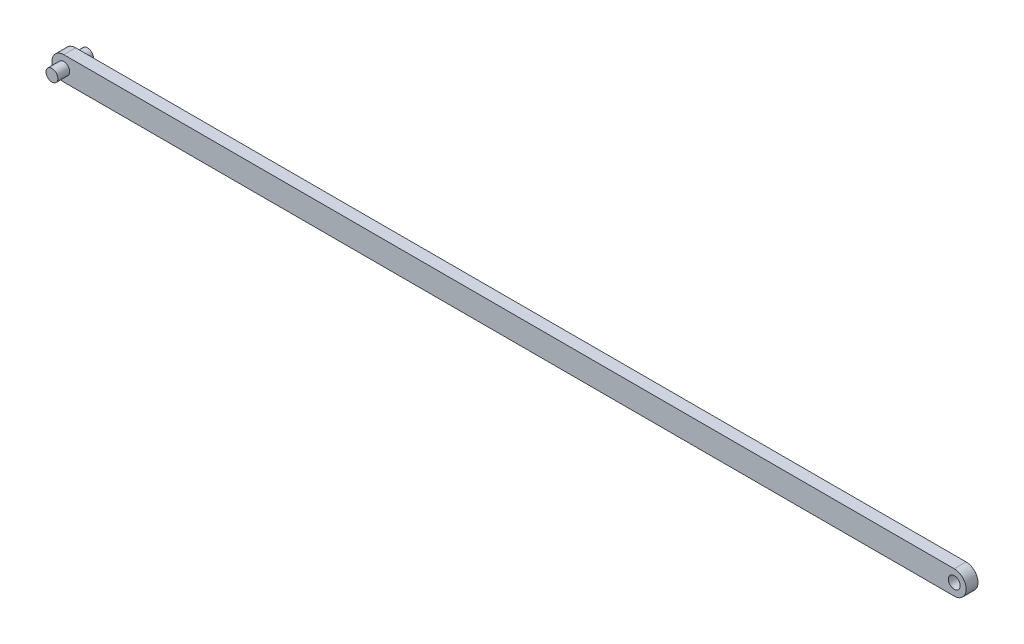
ISO-10303-21;
HEADER;
FILE_DESCRIPTION(('STEP AP214'),'2;1');
FILE_NAME('part.step','',(''),(''),'','','');
FILE_SCHEMA(('AUTOMOTIVE_DESIGN { 1 0 10303 214 1 1 1 1 }'));
ENDSEC;
DATA;
#1=APPLICATION_CONTEXT('core data for automotive mechanical design processes');
#2=APPLICATION_PROTOCOL_DEFINITION('international standard','automotive_design',2000,#1);
#3=PRODUCT_CONTEXT('',#1,'mechanical');
#4=PRODUCT('Part','Part','',(#3));
#5=PRODUCT_RELATED_PRODUCT_CATEGORY('part','',(#4));
#6=PRODUCT_DEFINITION_FORMATION('','',#4);
#7=PRODUCT_DEFINITION_CONTEXT('part definition',#1,'design');
#8=PRODUCT_DEFINITION('design','',#6,#7);
#9=PRODUCT_DEFINITION_SHAPE('','',#8);
#10=(LENGTH_UNIT() NAMED_UNIT(*) SI_UNIT(.MILLI.,.METRE.));
#11=(NAMED_UNIT(*) PLANE_ANGLE_UNIT() SI_UNIT($,.RADIAN.));
#12=(NAMED_UNIT(*) SI_UNIT($,.STERADIAN.) SOLID_ANGLE_UNIT());
#13=UNCERTAINTY_MEASURE_WITH_UNIT(LENGTH_MEASURE(1.E-05),#10,'distance_accuracy_value','');
#14=(GEOMETRIC_REPRESENTATION_CONTEXT(3) GLOBAL_UNCERTAINTY_ASSIGNED_CONTEXT((#13)) GLOBAL_UNIT_ASSIGNED_CONTEXT((#10,
#11,#12)) REPRESENTATION_CONTEXT('',''));
#15=CARTESIAN_POINT('',(0.,0.,0.));
#16=DIRECTION('',(0.,0.,1.));
#17=DIRECTION('',(1.,0.,0.));
#18=AXIS2_PLACEMENT_3D('',#15,#16,#17);
#19=CARTESIAN_POINT('',(-50.1591628706254,0.,2.));
#20=DIRECTION('',(0.,0.,1.));
#21=DIRECTION('',(1.,0.,0.));
#22=AXIS2_PLACEMENT_3D('',#19,#20,#21);
#23=PLANE('',#22);
#24=CARTESIAN_POINT('',(-50.1591628706254,0.,2.));
#25=DIRECTION('',(0.,0.,1.));
#26=DIRECTION('',(1.,0.,0.));
#27=AXIS2_PLACEMENT_3D('',#24,#25,#26);
#28=CIRCLE('',#27,0.999999999999998);
#29=CARTESIAN_POINT('',(-49.1591628706254,0.,2.));
#30=VERTEX_POINT('',#29);
#31=EDGE_CURVE('E11',#30,#30,#28,.T.);
#32=ORIENTED_EDGE('',*,*,#31,.F.);
#33=EDGE_LOOP('',(#32));
#34=FACE_BOUND('',#33,.T.);
#35=CARTESIAN_POINT('',(-50.1591628706254,0.,2.));
#36=DIRECTION('',(0.,0.,1.));
#37=DIRECTION('',(1.,0.,0.));
#38=AXIS2_PLACEMENT_3D('',#35,#36,#37);
#39=CIRCLE('',#38,2.);
#40=CARTESIAN_POINT('',(-50.1591628706254,2.,2.));
#41=VERTEX_POINT('',#40);
#42=CARTESIAN_POINT('',(-50.1591628706254,-2.,2.));
#43=VERTEX_POINT('',#42);
#44=EDGE_CURVE('E86',#41,#43,#39,.T.);
#45=ORIENTED_EDGE('',*,*,#44,.T.);
#46=DIRECTION('',(1.,0.,0.));
#47=VECTOR('',#46,1.);
#48=CARTESIAN_POINT('',(-50.1591628706254,-2.,2.));
#49=LINE('',#48,#47);
#50=CARTESIAN_POINT('',(99.8408371293745,-2.,2.));
#51=VERTEX_POINT('',#50);
#52=EDGE_CURVE('E81',#43,#51,#49,.T.);
#53=ORIENTED_EDGE('',*,*,#52,.T.);
#54=CARTESIAN_POINT('',(99.8408371293745,0.,2.));
#55=DIRECTION('',(0.,0.,1.));
#56=DIRECTION('',(1.,0.,0.));
#57=AXIS2_PLACEMENT_3D('',#54,#55,#56);
#58=CIRCLE('',#57,2.);
#59=CARTESIAN_POINT('',(99.8408371293745,2.,2.));
#60=VERTEX_POINT('',#59);
#61=EDGE_CURVE('E84',#51,#60,#58,.T.);
#62=ORIENTED_EDGE('',*,*,#61,.T.);
#63=DIRECTION('',(-1.,0.,0.));
#64=VECTOR('',#63,1.);
#65=CARTESIAN_POINT('',(-50.1591628706254,2.,2.));
#66=LINE('',#65,#64);
#67=EDGE_CURVE('E50',#60,#41,#66,.T.);
#68=ORIENTED_EDGE('',*,*,#67,.T.);
#69=EDGE_LOOP('',(#45,#53,#62,#68));
#70=FACE_BOUND('',#69,.T.);
#71=CARTESIAN_POINT('',(99.8408371293745,0.,2.));
#72=DIRECTION('',(0.,0.,1.));
#73=DIRECTION('',(1.,0.,0.));
#74=AXIS2_PLACEMENT_3D('',#71,#72,#73);
#75=CIRCLE('',#74,0.999999999999998);
#76=CARTESIAN_POINT('',(100.840837129375,0.,2.));
#77=VERTEX_POINT('',#76);
#78=EDGE_CURVE('E103',#77,#77,#75,.T.);
#79=ORIENTED_EDGE('',*,*,#78,.F.);
#80=EDGE_LOOP('',(#79));
#81=FACE_BOUND('',#80,.T.);
#82=ADVANCED_FACE('F31',(#34,#70,#81),#23,.T.);
#83=CARTESIAN_POINT('',(-50.1591628706254,0.,0.));
#84=DIRECTION('',(0.,0.,1.));
#85=DIRECTION('',(1.,0.,0.));
#86=AXIS2_PLACEMENT_3D('',#83,#84,#85);
#87=PLANE('',#86);
#88=CARTESIAN_POINT('',(-50.1591628706254,0.,0.));
#89=DIRECTION('',(0.,0.,1.));
#90=DIRECTION('',(1.,0.,0.));
#91=AXIS2_PLACEMENT_3D('',#88,#89,#90);
#92=CIRCLE('',#91,0.999999999999998);
#93=CARTESIAN_POINT('',(-49.1591628706254,0.,0.));
#94=VERTEX_POINT('',#93);
#95=EDGE_CURVE('E35',#94,#94,#92,.T.);
#96=ORIENTED_EDGE('',*,*,#95,.T.);
#97=EDGE_LOOP('',(#96));
#98=FACE_BOUND('',#97,.T.);
#99=CARTESIAN_POINT('',(-50.1591628706254,0.,0.));
#100=DIRECTION('',(0.,0.,1.));
#101=DIRECTION('',(1.,0.,0.));
#102=AXIS2_PLACEMENT_3D('',#99,#100,#101);
#103=CIRCLE('',#102,2.);
#104=CARTESIAN_POINT('',(-50.1591628706254,2.,0.));
#105=VERTEX_POINT('',#104);
#106=CARTESIAN_POINT('',(-50.1591628706254,-2.,0.));
#107=VERTEX_POINT('',#106);
#108=EDGE_CURVE('E100',#105,#107,#103,.T.);
#109=ORIENTED_EDGE('',*,*,#108,.F.);
#110=DIRECTION('',(-1.,0.,0.));
#111=VECTOR('',#110,1.);
#112=CARTESIAN_POINT('',(-50.1591628706254,2.,0.));
#113=LINE('',#112,#111);
#114=CARTESIAN_POINT('',(99.8408371293745,2.,0.));
#115=VERTEX_POINT('',#114);
#116=EDGE_CURVE('E73',#115,#105,#113,.T.);
#117=ORIENTED_EDGE('',*,*,#116,.F.);
#118=CARTESIAN_POINT('',(99.8408371293745,0.,0.));
#119=DIRECTION('',(0.,0.,1.));
#120=DIRECTION('',(1.,0.,0.));
#121=AXIS2_PLACEMENT_3D('',#118,#119,#120);
#122=CIRCLE('',#121,2.);
#123=CARTESIAN_POINT('',(99.8408371293745,-2.,0.));
#124=VERTEX_POINT('',#123);
#125=EDGE_CURVE('E67',#124,#115,#122,.T.);
#126=ORIENTED_EDGE('',*,*,#125,.F.);
#127=DIRECTION('',(1.,0.,0.));
#128=VECTOR('',#127,1.);
#129=CARTESIAN_POINT('',(-50.1591628706254,-2.,0.));
#130=LINE('',#129,#128);
#131=EDGE_CURVE('E91',#107,#124,#130,.T.);
#132=ORIENTED_EDGE('',*,*,#131,.F.);
#133=EDGE_LOOP('',(#109,#117,#126,#132));
#134=FACE_BOUND('',#133,.T.);
#135=CARTESIAN_POINT('',(99.8408371293745,0.,0.));
#136=DIRECTION('',(0.,0.,1.));
#137=DIRECTION('',(1.,0.,0.));
#138=AXIS2_PLACEMENT_3D('',#135,#136,#137);
#139=CIRCLE('',#138,0.999999999999998);
#140=CARTESIAN_POINT('',(100.840837129375,0.,0.));
#141=VERTEX_POINT('',#140);
#142=EDGE_CURVE('E118',#141,#141,#139,.T.);
#143=ORIENTED_EDGE('',*,*,#142,.T.);
#144=EDGE_LOOP('',(#143));
#145=FACE_BOUND('',#144,.T.);
#146=ADVANCED_FACE('F111',(#98,#134,#145),#87,.F.);
#147=CARTESIAN_POINT('',(-50.1591628706254,0.,2.));
#148=DIRECTION('',(0.,0.,-1.));
#149=DIRECTION('',(-1.,0.,0.));
#150=AXIS2_PLACEMENT_3D('',#147,#148,#149);
#151=CYLINDRICAL_SURFACE('',#150,2.);
#152=ORIENTED_EDGE('',*,*,#108,.T.);
#153=DIRECTION('',(0.,0.,-1.));
#154=VECTOR('',#153,1.);
#155=CARTESIAN_POINT('',(-50.1591628706254,-2.,2.));
#156=LINE('',#155,#154);
#157=EDGE_CURVE('E41',#43,#107,#156,.T.);
#158=ORIENTED_EDGE('',*,*,#157,.F.);
#159=ORIENTED_EDGE('',*,*,#44,.F.);
#160=DIRECTION('',(0.,0.,-1.));
#161=VECTOR('',#160,1.);
#162=CARTESIAN_POINT('',(-50.1591628706254,2.,2.));
#163=LINE('',#162,#161);
#164=EDGE_CURVE('E96',#41,#105,#163,.T.);
#165=ORIENTED_EDGE('',*,*,#164,.T.);
#166=EDGE_LOOP('',(#152,#158,#159,#165));
#167=FACE_BOUND('',#166,.T.);
#168=ADVANCED_FACE('F33',(#167),#151,.T.);
#169=CARTESIAN_POINT('',(-50.1591628706254,-2.,2.));
#170=DIRECTION('',(0.,1.,0.));
#171=DIRECTION('',(0.,0.,1.));
#172=AXIS2_PLACEMENT_3D('',#169,#170,#171);
#173=PLANE('',#172);
#174=ORIENTED_EDGE('',*,*,#131,.T.);
#175=DIRECTION('',(0.,0.,-1.));
#176=VECTOR('',#175,1.);
#177=CARTESIAN_POINT('',(99.8408371293745,-2.,2.));
#178=LINE('',#177,#176);
#179=EDGE_CURVE('E89',#51,#124,#178,.T.);
#180=ORIENTED_EDGE('',*,*,#179,.F.);
#181=ORIENTED_EDGE('',*,*,#52,.F.);
#182=ORIENTED_EDGE('',*,*,#157,.T.);
#183=EDGE_LOOP('',(#174,#180,#181,#182));
#184=FACE_BOUND('',#183,.T.);
#185=ADVANCED_FACE('F90',(#184),#173,.F.);
#186=CARTESIAN_POINT('',(99.8408371293745,0.,2.));
#187=DIRECTION('',(0.,0.,-1.));
#188=DIRECTION('',(-1.,0.,0.));
#189=AXIS2_PLACEMENT_3D('',#186,#187,#188);
#190=CYLINDRICAL_SURFACE('',#189,2.);
#191=ORIENTED_EDGE('',*,*,#125,.T.);
#192=DIRECTION('',(0.,0.,-1.));
#193=VECTOR('',#192,1.);
#194=CARTESIAN_POINT('',(99.8408371293745,2.,2.));
#195=LINE('',#194,#193);
#196=EDGE_CURVE('E92',#60,#115,#195,.T.);
#197=ORIENTED_EDGE('',*,*,#196,.F.);
#198=ORIENTED_EDGE('',*,*,#61,.F.);
#199=ORIENTED_EDGE('',*,*,#179,.T.);
#200=EDGE_LOOP('',(#191,#197,#198,#199));
#201=FACE_BOUND('',#200,.T.);
#202=ADVANCED_FACE('F94',(#201),#190,.T.);
#203=CARTESIAN_POINT('',(-50.1591628706254,2.,2.));
#204=DIRECTION('',(0.,-1.,0.));
#205=DIRECTION('',(0.,0.,-1.));
#206=AXIS2_PLACEMENT_3D('',#203,#204,#205);
#207=PLANE('',#206);
#208=ORIENTED_EDGE('',*,*,#116,.T.);
#209=ORIENTED_EDGE('',*,*,#164,.F.);
#210=ORIENTED_EDGE('',*,*,#67,.F.);
#211=ORIENTED_EDGE('',*,*,#196,.T.);
#212=EDGE_LOOP('',(#208,#209,#210,#211));
#213=FACE_BOUND('',#212,.T.);
#214=ADVANCED_FACE('F156',(#213),#207,.F.);
#215=CARTESIAN_POINT('',(99.8408371293745,0.,2.));
#216=DIRECTION('',(0.,0.,-1.));
#217=DIRECTION('',(-1.,0.,0.));
#218=AXIS2_PLACEMENT_3D('',#215,#216,#217);
#219=CYLINDRICAL_SURFACE('',#218,0.999999999999998);
#220=ORIENTED_EDGE('',*,*,#78,.T.);
#221=EDGE_LOOP('',(#220));
#222=FACE_BOUND('',#221,.T.);
#223=ORIENTED_EDGE('',*,*,#142,.F.);
#224=EDGE_LOOP('',(#223));
#225=FACE_BOUND('',#224,.T.);
#226=ADVANCED_FACE('F154',(#222,#225),#219,.F.);
#227=CARTESIAN_POINT('',(-50.1591628706254,0.,-2.));
#228=DIRECTION('',(0.,0.,1.));
#229=DIRECTION('',(1.,0.,0.));
#230=AXIS2_PLACEMENT_3D('',#227,#228,#229);
#231=PLANE('',#230);
#232=CARTESIAN_POINT('',(-50.1591628706254,0.,-2.));
#233=DIRECTION('',(0.,0.,1.));
#234=DIRECTION('',(1.,0.,0.));
#235=AXIS2_PLACEMENT_3D('',#232,#233,#234);
#236=CIRCLE('',#235,0.999999999999998);
#237=CARTESIAN_POINT('',(-49.1591628706254,0.,-2.));
#238=VERTEX_POINT('',#237);
#239=EDGE_CURVE('E124',#238,#238,#236,.T.);
#240=ORIENTED_EDGE('',*,*,#239,.F.);
#241=EDGE_LOOP('',(#240));
#242=FACE_BOUND('',#241,.T.);
#243=ADVANCED_FACE('F144',(#242),#231,.F.);
#244=CARTESIAN_POINT('',(-50.1591628706254,0.,-2.));
#245=DIRECTION('',(0.,0.,1.));
#246=DIRECTION('',(1.,0.,0.));
#247=AXIS2_PLACEMENT_3D('',#244,#245,#246);
#248=CYLINDRICAL_SURFACE('',#247,0.999999999999998);
#249=ORIENTED_EDGE('',*,*,#239,.T.);
#250=EDGE_LOOP('',(#249));
#251=FACE_BOUND('',#250,.T.);
#252=ORIENTED_EDGE('',*,*,#95,.F.);
#253=EDGE_LOOP('',(#252));
#254=FACE_BOUND('',#253,.T.);
#255=ADVANCED_FACE('F136',(#251,#254),#248,.T.);
#256=ORIENTED_EDGE('',*,*,#31,.T.);
#257=EDGE_LOOP('',(#256));
#258=FACE_BOUND('',#257,.T.);
#259=CARTESIAN_POINT('',(-50.1591628706254,0.,4.));
#260=DIRECTION('',(0.,0.,1.));
#261=DIRECTION('',(1.,0.,0.));
#262=AXIS2_PLACEMENT_3D('',#259,#260,#261);
#263=CIRCLE('',#262,0.999999999999998);
#264=CARTESIAN_POINT('',(-49.1591628706254,0.,4.));
#265=VERTEX_POINT('',#264);
#266=EDGE_CURVE('E128',#265,#265,#263,.T.);
#267=ORIENTED_EDGE('',*,*,#266,.F.);
#268=EDGE_LOOP('',(#267));
#269=FACE_BOUND('',#268,.T.);
#270=ADVANCED_FACE('F134',(#258,#269),#248,.T.);
#271=CARTESIAN_POINT('',(-50.1591628706254,0.,4.));
#272=DIRECTION('',(0.,0.,1.));
#273=DIRECTION('',(1.,0.,0.));
#274=AXIS2_PLACEMENT_3D('',#271,#272,#273);
#275=PLANE('',#274);
#276=ORIENTED_EDGE('',*,*,#266,.T.);
#277=EDGE_LOOP('',(#276));
#278=FACE_BOUND('',#277,.T.);
#279=ADVANCED_FACE('F132',(#278),#275,.T.);
#280=CLOSED_SHELL('',(#82,#146,#168,#185,#202,#214,#226,#243,#255,#270,#279));
#281=MANIFOLD_SOLID_BREP('B2',#280);
#282=ADVANCED_BREP_SHAPE_REPRESENTATION('',(#18,#281),#14);
#283=SHAPE_DEFINITION_REPRESENTATION(#9,#282);
ENDSEC;
END-ISO-10303-21;
